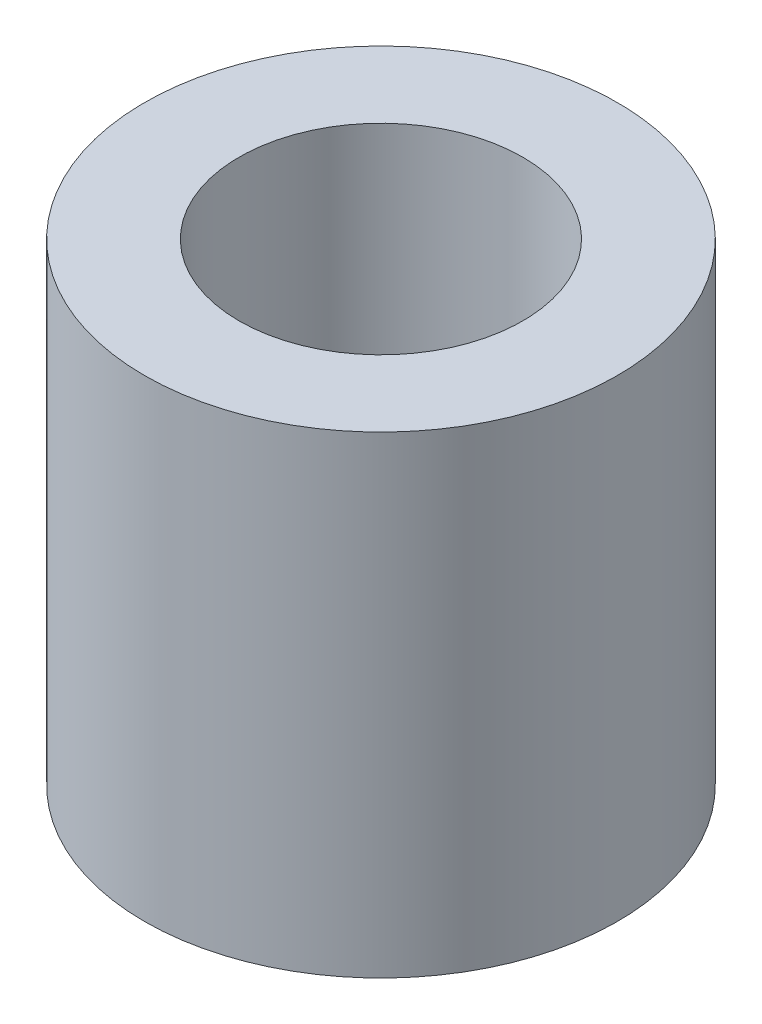
ISO-10303-21;
HEADER;
FILE_DESCRIPTION(('STEP AP214'),'2;1');
FILE_NAME('part.step','',(''),(''),'','','');
FILE_SCHEMA(('AUTOMOTIVE_DESIGN { 1 0 10303 214 1 1 1 1 }'));
ENDSEC;
DATA;
#1=APPLICATION_CONTEXT('core data for automotive mechanical design processes');
#2=APPLICATION_PROTOCOL_DEFINITION('international standard','automotive_design',2000,#1);
#3=PRODUCT_CONTEXT('',#1,'mechanical');
#4=PRODUCT('Part','Part','',(#3));
#5=PRODUCT_RELATED_PRODUCT_CATEGORY('part','',(#4));
#6=PRODUCT_DEFINITION_FORMATION('','',#4);
#7=PRODUCT_DEFINITION_CONTEXT('part definition',#1,'design');
#8=PRODUCT_DEFINITION('design','',#6,#7);
#9=PRODUCT_DEFINITION_SHAPE('','',#8);
#10=(LENGTH_UNIT() NAMED_UNIT(*) SI_UNIT(.MILLI.,.METRE.));
#11=(NAMED_UNIT(*) PLANE_ANGLE_UNIT() SI_UNIT($,.RADIAN.));
#12=(NAMED_UNIT(*) SI_UNIT($,.STERADIAN.) SOLID_ANGLE_UNIT());
#13=UNCERTAINTY_MEASURE_WITH_UNIT(LENGTH_MEASURE(1.E-05),#10,'distance_accuracy_value','');
#14=(GEOMETRIC_REPRESENTATION_CONTEXT(3) GLOBAL_UNCERTAINTY_ASSIGNED_CONTEXT((#13)) GLOBAL_UNIT_ASSIGNED_CONTEXT((#10,
#11,#12)) REPRESENTATION_CONTEXT('',''));
#15=CARTESIAN_POINT('',(0.,0.,0.));
#16=DIRECTION('',(0.,0.,1.));
#17=DIRECTION('',(1.,0.,0.));
#18=AXIS2_PLACEMENT_3D('',#15,#16,#17);
#19=CARTESIAN_POINT('',(0.,5.,0.));
#20=DIRECTION('',(0.,1.,0.));
#21=DIRECTION('',(0.,0.,1.));
#22=AXIS2_PLACEMENT_3D('',#19,#20,#21);
#23=PLANE('',#22);
#24=CARTESIAN_POINT('',(0.,5.,0.));
#25=DIRECTION('',(0.,1.,0.));
#26=DIRECTION('',(0.,0.,1.));
#27=AXIS2_PLACEMENT_3D('',#24,#25,#26);
#28=CIRCLE('',#27,2.5);
#29=CARTESIAN_POINT('',(0.,5.,2.5));
#30=VERTEX_POINT('',#29);
#31=EDGE_CURVE('E10',#30,#30,#28,.T.);
#32=ORIENTED_EDGE('',*,*,#31,.T.);
#33=EDGE_LOOP('',(#32));
#34=FACE_BOUND('',#33,.T.);
#35=CARTESIAN_POINT('',(0.,5.,0.));
#36=DIRECTION('',(0.,1.,0.));
#37=DIRECTION('',(0.,0.,1.));
#38=AXIS2_PLACEMENT_3D('',#35,#36,#37);
#39=CIRCLE('',#38,1.5);
#40=CARTESIAN_POINT('',(0.,5.,1.5));
#41=VERTEX_POINT('',#40);
#42=EDGE_CURVE('E39',#41,#41,#39,.T.);
#43=ORIENTED_EDGE('',*,*,#42,.F.);
#44=EDGE_LOOP('',(#43));
#45=FACE_BOUND('',#44,.T.);
#46=ADVANCED_FACE('F28',(#34,#45),#23,.T.);
#47=CARTESIAN_POINT('',(0.,0.,0.));
#48=DIRECTION('',(0.,1.,0.));
#49=DIRECTION('',(0.,0.,1.));
#50=AXIS2_PLACEMENT_3D('',#47,#48,#49);
#51=PLANE('',#50);
#52=CARTESIAN_POINT('',(0.,0.,0.));
#53=DIRECTION('',(0.,1.,0.));
#54=DIRECTION('',(0.,0.,1.));
#55=AXIS2_PLACEMENT_3D('',#52,#53,#54);
#56=CIRCLE('',#55,2.5);
#57=CARTESIAN_POINT('',(0.,0.,2.5));
#58=VERTEX_POINT('',#57);
#59=EDGE_CURVE('E32',#58,#58,#56,.T.);
#60=ORIENTED_EDGE('',*,*,#59,.F.);
#61=EDGE_LOOP('',(#60));
#62=FACE_BOUND('',#61,.T.);
#63=CARTESIAN_POINT('',(0.,0.,0.));
#64=DIRECTION('',(0.,1.,0.));
#65=DIRECTION('',(0.,0.,1.));
#66=AXIS2_PLACEMENT_3D('',#63,#64,#65);
#67=CIRCLE('',#66,1.5);
#68=CARTESIAN_POINT('',(0.,0.,1.5));
#69=VERTEX_POINT('',#68);
#70=EDGE_CURVE('E41',#69,#69,#67,.T.);
#71=ORIENTED_EDGE('',*,*,#70,.T.);
#72=EDGE_LOOP('',(#71));
#73=FACE_BOUND('',#72,.T.);
#74=ADVANCED_FACE('F51',(#62,#73),#51,.F.);
#75=CARTESIAN_POINT('',(0.,5.,0.));
#76=DIRECTION('',(0.,-1.,0.));
#77=DIRECTION('',(0.,0.,-1.));
#78=AXIS2_PLACEMENT_3D('',#75,#76,#77);
#79=CYLINDRICAL_SURFACE('',#78,2.5);
#80=ORIENTED_EDGE('',*,*,#31,.F.);
#81=EDGE_LOOP('',(#80));
#82=FACE_BOUND('',#81,.T.);
#83=ORIENTED_EDGE('',*,*,#59,.T.);
#84=EDGE_LOOP('',(#83));
#85=FACE_BOUND('',#84,.T.);
#86=ADVANCED_FACE('F30',(#82,#85),#79,.T.);
#87=CARTESIAN_POINT('',(0.,5.,0.));
#88=DIRECTION('',(0.,-1.,0.));
#89=DIRECTION('',(0.,0.,-1.));
#90=AXIS2_PLACEMENT_3D('',#87,#88,#89);
#91=CYLINDRICAL_SURFACE('',#90,1.5);
#92=ORIENTED_EDGE('',*,*,#42,.T.);
#93=EDGE_LOOP('',(#92));
#94=FACE_BOUND('',#93,.T.);
#95=ORIENTED_EDGE('',*,*,#70,.F.);
#96=EDGE_LOOP('',(#95));
#97=FACE_BOUND('',#96,.T.);
#98=ADVANCED_FACE('F47',(#94,#97),#91,.F.);
#99=CLOSED_SHELL('',(#46,#74,#86,#98));
#100=MANIFOLD_SOLID_BREP('B2',#99);
#101=ADVANCED_BREP_SHAPE_REPRESENTATION('',(#18,#100),#14);
#102=SHAPE_DEFINITION_REPRESENTATION(#9,#101);
ENDSEC;
END-ISO-10303-21;
